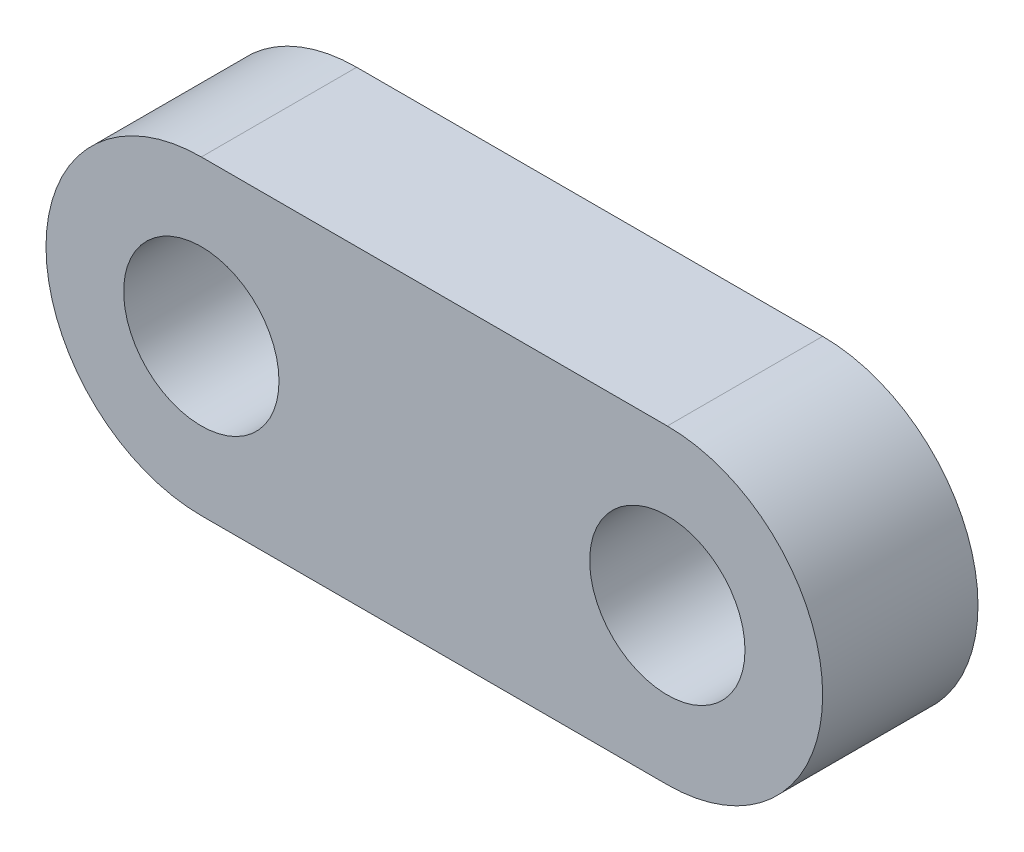
ISO-10303-21;
HEADER;
FILE_DESCRIPTION(('STEP AP214'),'2;1');
FILE_NAME('part.step','',(''),(''),'','','');
FILE_SCHEMA(('AUTOMOTIVE_DESIGN { 1 0 10303 214 1 1 1 1 }'));
ENDSEC;
DATA;
#1=APPLICATION_CONTEXT('core data for automotive mechanical design processes');
#2=APPLICATION_PROTOCOL_DEFINITION('international standard','automotive_design',2000,#1);
#3=PRODUCT_CONTEXT('',#1,'mechanical');
#4=PRODUCT('Part','Part','',(#3));
#5=PRODUCT_RELATED_PRODUCT_CATEGORY('part','',(#4));
#6=PRODUCT_DEFINITION_FORMATION('','',#4);
#7=PRODUCT_DEFINITION_CONTEXT('part definition',#1,'design');
#8=PRODUCT_DEFINITION('design','',#6,#7);
#9=PRODUCT_DEFINITION_SHAPE('','',#8);
#10=(LENGTH_UNIT() NAMED_UNIT(*) SI_UNIT(.MILLI.,.METRE.));
#11=(NAMED_UNIT(*) PLANE_ANGLE_UNIT() SI_UNIT($,.RADIAN.));
#12=(NAMED_UNIT(*) SI_UNIT($,.STERADIAN.) SOLID_ANGLE_UNIT());
#13=UNCERTAINTY_MEASURE_WITH_UNIT(LENGTH_MEASURE(1.E-05),#10,'distance_accuracy_value','');
#14=(GEOMETRIC_REPRESENTATION_CONTEXT(3) GLOBAL_UNCERTAINTY_ASSIGNED_CONTEXT((#13)) GLOBAL_UNIT_ASSIGNED_CONTEXT((#10,
#11,#12)) REPRESENTATION_CONTEXT('',''));
#15=CARTESIAN_POINT('',(0.,0.,0.));
#16=DIRECTION('',(0.,0.,1.));
#17=DIRECTION('',(1.,0.,0.));
#18=AXIS2_PLACEMENT_3D('',#15,#16,#17);
#19=CARTESIAN_POINT('',(0.,12.7,6.35));
#20=DIRECTION('',(0.,1.,0.));
#21=DIRECTION('',(0.,0.,1.));
#22=AXIS2_PLACEMENT_3D('',#19,#20,#21);
#23=PLANE('',#22);
#24=DIRECTION('',(1.,0.,0.));
#25=VECTOR('',#24,1.);
#26=CARTESIAN_POINT('',(0.,12.7,0.));
#27=LINE('',#26,#25);
#28=CARTESIAN_POINT('',(0.,12.7,0.));
#29=VERTEX_POINT('',#28);
#30=CARTESIAN_POINT('',(19.05,12.7,0.));
#31=VERTEX_POINT('',#30);
#32=EDGE_CURVE('E79',#29,#31,#27,.T.);
#33=ORIENTED_EDGE('',*,*,#32,.F.);
#34=DIRECTION('',(0.,0.,-1.));
#35=VECTOR('',#34,1.);
#36=CARTESIAN_POINT('',(0.,12.7,6.35));
#37=LINE('',#36,#35);
#38=CARTESIAN_POINT('',(0.,12.7,6.35));
#39=VERTEX_POINT('',#38);
#40=EDGE_CURVE('E43',#39,#29,#37,.T.);
#41=ORIENTED_EDGE('',*,*,#40,.F.);
#42=DIRECTION('',(1.,0.,0.));
#43=VECTOR('',#42,1.);
#44=CARTESIAN_POINT('',(0.,12.7,6.35));
#45=LINE('',#44,#43);
#46=CARTESIAN_POINT('',(19.05,12.7,6.35));
#47=VERTEX_POINT('',#46);
#48=EDGE_CURVE('E98',#39,#47,#45,.T.);
#49=ORIENTED_EDGE('',*,*,#48,.T.);
#50=DIRECTION('',(0.,0.,-1.));
#51=VECTOR('',#50,1.);
#52=CARTESIAN_POINT('',(19.05,12.7,6.35));
#53=LINE('',#52,#51);
#54=EDGE_CURVE('E11',#47,#31,#53,.T.);
#55=ORIENTED_EDGE('',*,*,#54,.T.);
#56=EDGE_LOOP('',(#33,#41,#49,#55));
#57=FACE_BOUND('',#56,.T.);
#58=ADVANCED_FACE('F35',(#57),#23,.T.);
#59=CARTESIAN_POINT('',(0.,6.35,6.35));
#60=DIRECTION('',(0.,0.,-1.));
#61=DIRECTION('',(-1.,0.,0.));
#62=AXIS2_PLACEMENT_3D('',#59,#60,#61);
#63=CYLINDRICAL_SURFACE('',#62,6.35);
#64=CARTESIAN_POINT('',(0.,6.35,0.));
#65=DIRECTION('',(0.,0.,1.));
#66=DIRECTION('',(1.,0.,0.));
#67=AXIS2_PLACEMENT_3D('',#64,#65,#66);
#68=CIRCLE('',#67,6.35);
#69=CARTESIAN_POINT('',(0.,0.,0.));
#70=VERTEX_POINT('',#69);
#71=EDGE_CURVE('E95',#29,#70,#68,.T.);
#72=ORIENTED_EDGE('',*,*,#71,.T.);
#73=DIRECTION('',(0.,0.,-1.));
#74=VECTOR('',#73,1.);
#75=CARTESIAN_POINT('',(0.,0.,6.35));
#76=LINE('',#75,#74);
#77=CARTESIAN_POINT('',(0.,0.,6.35));
#78=VERTEX_POINT('',#77);
#79=EDGE_CURVE('E65',#78,#70,#76,.T.);
#80=ORIENTED_EDGE('',*,*,#79,.F.);
#81=CARTESIAN_POINT('',(0.,6.35,6.35));
#82=DIRECTION('',(0.,0.,1.));
#83=DIRECTION('',(1.,0.,0.));
#84=AXIS2_PLACEMENT_3D('',#81,#82,#83);
#85=CIRCLE('',#84,6.35);
#86=EDGE_CURVE('E51',#39,#78,#85,.T.);
#87=ORIENTED_EDGE('',*,*,#86,.F.);
#88=ORIENTED_EDGE('',*,*,#40,.T.);
#89=EDGE_LOOP('',(#72,#80,#87,#88));
#90=FACE_BOUND('',#89,.T.);
#91=ADVANCED_FACE('F104',(#90),#63,.T.);
#92=CARTESIAN_POINT('',(0.,0.,6.35));
#93=DIRECTION('',(0.,-1.,0.));
#94=DIRECTION('',(1.,0.,0.));
#95=AXIS2_PLACEMENT_3D('',#92,#93,#94);
#96=PLANE('',#95);
#97=DIRECTION('',(-1.,0.,0.));
#98=VECTOR('',#97,1.);
#99=CARTESIAN_POINT('',(0.,0.,0.));
#100=LINE('',#99,#98);
#101=CARTESIAN_POINT('',(19.05,0.,0.));
#102=VERTEX_POINT('',#101);
#103=EDGE_CURVE('E77',#102,#70,#100,.T.);
#104=ORIENTED_EDGE('',*,*,#103,.F.);
#105=DIRECTION('',(0.,0.,-1.));
#106=VECTOR('',#105,1.);
#107=CARTESIAN_POINT('',(19.05,0.,6.35));
#108=LINE('',#107,#106);
#109=CARTESIAN_POINT('',(19.05,0.,6.35));
#110=VERTEX_POINT('',#109);
#111=EDGE_CURVE('E87',#110,#102,#108,.T.);
#112=ORIENTED_EDGE('',*,*,#111,.F.);
#113=DIRECTION('',(-1.,0.,0.));
#114=VECTOR('',#113,1.);
#115=CARTESIAN_POINT('',(0.,0.,6.35));
#116=LINE('',#115,#114);
#117=EDGE_CURVE('E111',#110,#78,#116,.T.);
#118=ORIENTED_EDGE('',*,*,#117,.T.);
#119=ORIENTED_EDGE('',*,*,#79,.T.);
#120=EDGE_LOOP('',(#104,#112,#118,#119));
#121=FACE_BOUND('',#120,.T.);
#122=ADVANCED_FACE('F93',(#121),#96,.T.);
#123=CARTESIAN_POINT('',(0.,6.35,6.35));
#124=DIRECTION('',(0.,0.,-1.));
#125=DIRECTION('',(-1.,0.,0.));
#126=AXIS2_PLACEMENT_3D('',#123,#124,#125);
#127=CYLINDRICAL_SURFACE('',#126,3.175);
#128=CARTESIAN_POINT('',(0.,6.35,6.35));
#129=DIRECTION('',(0.,0.,1.));
#130=DIRECTION('',(1.,0.,0.));
#131=AXIS2_PLACEMENT_3D('',#128,#129,#130);
#132=CIRCLE('',#131,3.175);
#133=CARTESIAN_POINT('',(3.175,6.35,6.35));
#134=VERTEX_POINT('',#133);
#135=EDGE_CURVE('E91',#134,#134,#132,.T.);
#136=ORIENTED_EDGE('',*,*,#135,.T.);
#137=EDGE_LOOP('',(#136));
#138=FACE_BOUND('',#137,.T.);
#139=CARTESIAN_POINT('',(0.,6.35,0.));
#140=DIRECTION('',(0.,0.,1.));
#141=DIRECTION('',(1.,0.,0.));
#142=AXIS2_PLACEMENT_3D('',#139,#140,#141);
#143=CIRCLE('',#142,3.175);
#144=CARTESIAN_POINT('',(3.175,6.35,0.));
#145=VERTEX_POINT('',#144);
#146=EDGE_CURVE('E94',#145,#145,#143,.T.);
#147=ORIENTED_EDGE('',*,*,#146,.F.);
#148=EDGE_LOOP('',(#147));
#149=FACE_BOUND('',#148,.T.);
#150=ADVANCED_FACE('F126',(#138,#149),#127,.F.);
#151=CARTESIAN_POINT('',(0.,0.,6.35));
#152=DIRECTION('',(0.,0.,1.));
#153=DIRECTION('',(1.,0.,0.));
#154=AXIS2_PLACEMENT_3D('',#151,#152,#153);
#155=PLANE('',#154);
#156=CARTESIAN_POINT('',(19.05,6.35,6.35));
#157=DIRECTION('',(0.,0.,1.));
#158=DIRECTION('',(1.,0.,0.));
#159=AXIS2_PLACEMENT_3D('',#156,#157,#158);
#160=CIRCLE('',#159,3.175);
#161=CARTESIAN_POINT('',(22.225,6.35,6.35));
#162=VERTEX_POINT('',#161);
#163=EDGE_CURVE('E83',#162,#162,#160,.T.);
#164=ORIENTED_EDGE('',*,*,#163,.F.);
#165=EDGE_LOOP('',(#164));
#166=FACE_BOUND('',#165,.T.);
#167=ORIENTED_EDGE('',*,*,#117,.F.);
#168=CARTESIAN_POINT('',(19.05,6.35,6.35));
#169=DIRECTION('',(0.,0.,1.));
#170=DIRECTION('',(1.,0.,0.));
#171=AXIS2_PLACEMENT_3D('',#168,#169,#170);
#172=CIRCLE('',#171,6.35);
#173=EDGE_CURVE('E82',#110,#47,#172,.T.);
#174=ORIENTED_EDGE('',*,*,#173,.T.);
#175=ORIENTED_EDGE('',*,*,#48,.F.);
#176=ORIENTED_EDGE('',*,*,#86,.T.);
#177=EDGE_LOOP('',(#167,#174,#175,#176));
#178=FACE_BOUND('',#177,.T.);
#179=ORIENTED_EDGE('',*,*,#135,.F.);
#180=EDGE_LOOP('',(#179));
#181=FACE_BOUND('',#180,.T.);
#182=ADVANCED_FACE('F124',(#166,#178,#181),#155,.T.);
#183=CARTESIAN_POINT('',(0.,0.,0.));
#184=DIRECTION('',(0.,0.,1.));
#185=DIRECTION('',(1.,0.,0.));
#186=AXIS2_PLACEMENT_3D('',#183,#184,#185);
#187=PLANE('',#186);
#188=CARTESIAN_POINT('',(19.05,6.35,0.));
#189=DIRECTION('',(0.,0.,1.));
#190=DIRECTION('',(1.,0.,0.));
#191=AXIS2_PLACEMENT_3D('',#188,#189,#190);
#192=CIRCLE('',#191,3.175);
#193=CARTESIAN_POINT('',(22.225,6.35,0.));
#194=VERTEX_POINT('',#193);
#195=EDGE_CURVE('E115',#194,#194,#192,.T.);
#196=ORIENTED_EDGE('',*,*,#195,.T.);
#197=EDGE_LOOP('',(#196));
#198=FACE_BOUND('',#197,.T.);
#199=ORIENTED_EDGE('',*,*,#32,.T.);
#200=CARTESIAN_POINT('',(19.05,6.35,0.));
#201=DIRECTION('',(0.,0.,1.));
#202=DIRECTION('',(1.,0.,0.));
#203=AXIS2_PLACEMENT_3D('',#200,#201,#202);
#204=CIRCLE('',#203,6.35);
#205=EDGE_CURVE('E72',#102,#31,#204,.T.);
#206=ORIENTED_EDGE('',*,*,#205,.F.);
#207=ORIENTED_EDGE('',*,*,#103,.T.);
#208=ORIENTED_EDGE('',*,*,#71,.F.);
#209=EDGE_LOOP('',(#199,#206,#207,#208));
#210=FACE_BOUND('',#209,.T.);
#211=ORIENTED_EDGE('',*,*,#146,.T.);
#212=EDGE_LOOP('',(#211));
#213=FACE_BOUND('',#212,.T.);
#214=ADVANCED_FACE('F74',(#198,#210,#213),#187,.F.);
#215=CARTESIAN_POINT('',(19.05,6.35,6.35));
#216=DIRECTION('',(0.,0.,-1.));
#217=DIRECTION('',(-1.,0.,0.));
#218=AXIS2_PLACEMENT_3D('',#215,#216,#217);
#219=CYLINDRICAL_SURFACE('',#218,6.35);
#220=ORIENTED_EDGE('',*,*,#205,.T.);
#221=ORIENTED_EDGE('',*,*,#54,.F.);
#222=ORIENTED_EDGE('',*,*,#173,.F.);
#223=ORIENTED_EDGE('',*,*,#111,.T.);
#224=EDGE_LOOP('',(#220,#221,#222,#223));
#225=FACE_BOUND('',#224,.T.);
#226=ADVANCED_FACE('F88',(#225),#219,.T.);
#227=CARTESIAN_POINT('',(19.05,6.35,6.35));
#228=DIRECTION('',(0.,0.,-1.));
#229=DIRECTION('',(-1.,0.,0.));
#230=AXIS2_PLACEMENT_3D('',#227,#228,#229);
#231=CYLINDRICAL_SURFACE('',#230,3.175);
#232=ORIENTED_EDGE('',*,*,#163,.T.);
#233=EDGE_LOOP('',(#232));
#234=FACE_BOUND('',#233,.T.);
#235=ORIENTED_EDGE('',*,*,#195,.F.);
#236=EDGE_LOOP('',(#235));
#237=FACE_BOUND('',#236,.T.);
#238=ADVANCED_FACE('F121',(#234,#237),#231,.F.);
#239=CLOSED_SHELL('',(#58,#91,#122,#150,#182,#214,#226,#238));
#240=MANIFOLD_SOLID_BREP('B2',#239);
#241=ADVANCED_BREP_SHAPE_REPRESENTATION('',(#18,#240),#14);
#242=SHAPE_DEFINITION_REPRESENTATION(#9,#241);
ENDSEC;
END-ISO-10303-21;
